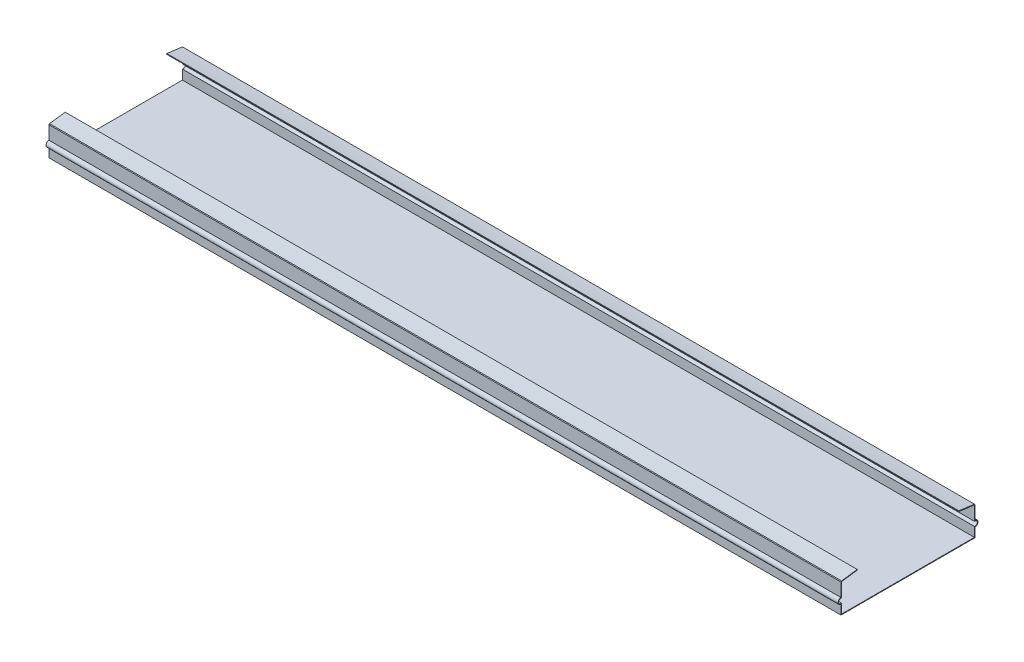
ISO-10303-21;
HEADER;
FILE_DESCRIPTION(('STEP AP214'),'2;1');
FILE_NAME('part.step','',(''),(''),'','','');
FILE_SCHEMA(('AUTOMOTIVE_DESIGN { 1 0 10303 214 1 1 1 1 }'));
ENDSEC;
DATA;
#1=APPLICATION_CONTEXT('core data for automotive mechanical design processes');
#2=APPLICATION_PROTOCOL_DEFINITION('international standard','automotive_design',2000,#1);
#3=PRODUCT_CONTEXT('',#1,'mechanical');
#4=PRODUCT('Part','Part','',(#3));
#5=PRODUCT_RELATED_PRODUCT_CATEGORY('part','',(#4));
#6=PRODUCT_DEFINITION_FORMATION('','',#4);
#7=PRODUCT_DEFINITION_CONTEXT('part definition',#1,'design');
#8=PRODUCT_DEFINITION('design','',#6,#7);
#9=PRODUCT_DEFINITION_SHAPE('','',#8);
#10=(LENGTH_UNIT() NAMED_UNIT(*) SI_UNIT(.MILLI.,.METRE.));
#11=(NAMED_UNIT(*) PLANE_ANGLE_UNIT() SI_UNIT($,.RADIAN.));
#12=(NAMED_UNIT(*) SI_UNIT($,.STERADIAN.) SOLID_ANGLE_UNIT());
#13=UNCERTAINTY_MEASURE_WITH_UNIT(LENGTH_MEASURE(1.E-05),#10,'distance_accuracy_value','');
#14=(GEOMETRIC_REPRESENTATION_CONTEXT(3) GLOBAL_UNCERTAINTY_ASSIGNED_CONTEXT((#13)) GLOBAL_UNIT_ASSIGNED_CONTEXT((#10,
#11,#12)) REPRESENTATION_CONTEXT('',''));
#15=CARTESIAN_POINT('',(0.,0.,0.));
#16=DIRECTION('',(0.,0.,1.));
#17=DIRECTION('',(1.,0.,0.));
#18=AXIS2_PLACEMENT_3D('',#15,#16,#17);
#19=CARTESIAN_POINT('',(0.,0.2,0.));
#20=DIRECTION('',(0.,1.,0.));
#21=DIRECTION('',(0.,0.,1.));
#22=AXIS2_PLACEMENT_3D('',#19,#20,#21);
#23=PLANE('',#22);
#24=DIRECTION('',(-1.,0.,0.));
#25=VECTOR('',#24,1.);
#26=CARTESIAN_POINT('',(120.981837705448,0.2,21.2968));
#27=LINE('',#26,#25);
#28=CARTESIAN_POINT('',(120.981837705448,0.2,21.2968));
#29=VERTEX_POINT('',#28);
#30=CARTESIAN_POINT('',(-133.018162294552,0.2,21.2968));
#31=VERTEX_POINT('',#30);
#32=EDGE_CURVE('E196',#29,#31,#27,.T.);
#33=ORIENTED_EDGE('',*,*,#32,.F.);
#34=DIRECTION('',(0.,0.,-1.));
#35=VECTOR('',#34,1.);
#36=CARTESIAN_POINT('',(120.981837705448,0.2,-21.5));
#37=LINE('',#36,#35);
#38=CARTESIAN_POINT('',(120.981837705448,0.2,-21.2968));
#39=VERTEX_POINT('',#38);
#40=EDGE_CURVE('E37',#29,#39,#37,.T.);
#41=ORIENTED_EDGE('',*,*,#40,.T.);
#42=DIRECTION('',(-1.,0.,0.));
#43=VECTOR('',#42,1.);
#44=CARTESIAN_POINT('',(120.981837705448,0.2,-21.2968));
#45=LINE('',#44,#43);
#46=CARTESIAN_POINT('',(-133.018162294552,0.2,-21.2968));
#47=VERTEX_POINT('',#46);
#48=EDGE_CURVE('E307',#39,#47,#45,.T.);
#49=ORIENTED_EDGE('',*,*,#48,.T.);
#50=DIRECTION('',(0.,0.,1.));
#51=VECTOR('',#50,1.);
#52=CARTESIAN_POINT('',(-133.018162294552,0.2,-21.5));
#53=LINE('',#52,#51);
#54=EDGE_CURVE('E51',#47,#31,#53,.T.);
#55=ORIENTED_EDGE('',*,*,#54,.T.);
#56=EDGE_LOOP('',(#33,#41,#49,#55));
#57=FACE_BOUND('',#56,.T.);
#58=ADVANCED_FACE('F33',(#57),#23,.T.);
#59=CARTESIAN_POINT('',(-133.018162294552,0.2,-21.5));
#60=DIRECTION('',(1.,0.,0.));
#61=DIRECTION('',(0.,0.,-1.));
#62=AXIS2_PLACEMENT_3D('',#59,#60,#61);
#63=PLANE('',#62);
#64=DIRECTION('',(0.,0.,1.));
#65=VECTOR('',#64,1.);
#66=CARTESIAN_POINT('',(-133.018162294552,0.,-21.5));
#67=LINE('',#66,#65);
#68=CARTESIAN_POINT('',(-133.018162294552,0.,-21.5));
#69=VERTEX_POINT('',#68);
#70=CARTESIAN_POINT('',(-133.018162294552,0.,21.5));
#71=VERTEX_POINT('',#70);
#72=EDGE_CURVE('E373',#69,#71,#67,.T.);
#73=ORIENTED_EDGE('',*,*,#72,.T.);
#74=DIRECTION('',(0.,-1.,0.));
#75=VECTOR('',#74,1.);
#76=CARTESIAN_POINT('',(-133.018162294552,0.2,21.5));
#77=LINE('',#76,#75);
#78=CARTESIAN_POINT('',(-133.018162294552,3.00561190530003,21.5));
#79=VERTEX_POINT('',#78);
#80=EDGE_CURVE('E11',#79,#71,#77,.T.);
#81=ORIENTED_EDGE('',*,*,#80,.F.);
#82=CARTESIAN_POINT('',(-133.018162294552,3.94490993934206,21.5));
#83=DIRECTION('',(-1.,0.,0.));
#84=DIRECTION('',(0.,0.,1.));
#85=AXIS2_PLACEMENT_3D('',#82,#83,#84);
#86=CIRCLE('',#85,0.939298034042025);
#87=CARTESIAN_POINT('',(-133.018162294552,4.88420797338408,21.5));
#88=VERTEX_POINT('',#87);
#89=EDGE_CURVE('E205',#79,#88,#86,.T.);
#90=ORIENTED_EDGE('',*,*,#89,.T.);
#91=DIRECTION('',(0.,1.,0.));
#92=VECTOR('',#91,1.);
#93=CARTESIAN_POINT('',(-133.018162294552,4.88420797338408,21.5));
#94=LINE('',#93,#92);
#95=CARTESIAN_POINT('',(-133.018162294552,9.2,21.5));
#96=VERTEX_POINT('',#95);
#97=EDGE_CURVE('E210',#88,#96,#94,.T.);
#98=ORIENTED_EDGE('',*,*,#97,.T.);
#99=DIRECTION('',(0.,0.741620224061098,-0.670819978282971));
#100=VECTOR('',#99,1.);
#101=CARTESIAN_POINT('',(-133.018162294552,9.40218142448018,21.3171202262577));
#102=LINE('',#101,#100);
#103=CARTESIAN_POINT('',(-133.018162294552,9.40218142448018,21.3171202262577));
#104=VERTEX_POINT('',#103);
#105=EDGE_CURVE('E463',#96,#104,#102,.T.);
#106=ORIENTED_EDGE('',*,*,#105,.T.);
#107=CARTESIAN_POINT('',(-133.018162294552,9.40218142448018,21.3171202262577));
#108=CARTESIAN_POINT('',(-133.018162294552,9.57156316738654,19.631812118589));
#109=CARTESIAN_POINT('',(-133.018162294552,9.79606406108942,17.9511350221585));
#110=CARTESIAN_POINT('',(-133.018162294552,10.0750848825269,16.2804761779272));
#111=B_SPLINE_CURVE_WITH_KNOTS('',3,(#107,#108,#109,#110),.UNSPECIFIED.,.F.,.F.,(4,4),(0.,1.),.UNSPECIFIED.);
#112=CARTESIAN_POINT('',(-133.018162294552,10.0750848825269,16.2804761779272));
#113=VERTEX_POINT('',#112);
#114=EDGE_CURVE('E458',#104,#113,#111,.T.);
#115=ORIENTED_EDGE('',*,*,#114,.T.);
#116=DIRECTION('',(0.,-0.986338561581543,-0.164730816598634));
#117=VECTOR('',#116,1.);
#118=CARTESIAN_POINT('',(-133.018162294552,10.0750848825269,16.2804761779272));
#119=LINE('',#118,#117);
#120=CARTESIAN_POINT('',(-133.018162294552,9.87466088681352,16.2470028759944));
#121=VERTEX_POINT('',#120);
#122=EDGE_CURVE('E452',#113,#121,#119,.T.);
#123=ORIENTED_EDGE('',*,*,#122,.T.);
#124=CARTESIAN_POINT('',(-133.018162294552,9.87466088681352,16.2470028759944));
#125=CARTESIAN_POINT('',(-133.018162294552,9.45496353887915,18.7599733511534));
#126=CARTESIAN_POINT('',(-133.018162294552,9.2,21.2968));
#127=B_SPLINE_CURVE_WITH_KNOTS('',2,(#124,#125,#126),.UNSPECIFIED.,.F.,.F.,(3,3),(0.,1.),.UNSPECIFIED.);
#128=CARTESIAN_POINT('',(-133.018162294552,9.2,21.2968));
#129=VERTEX_POINT('',#128);
#130=EDGE_CURVE('E447',#121,#129,#127,.T.);
#131=ORIENTED_EDGE('',*,*,#130,.T.);
#132=DIRECTION('',(0.,-1.,0.));
#133=VECTOR('',#132,1.);
#134=CARTESIAN_POINT('',(-133.018162294552,4.65240557588022,21.2968));
#135=LINE('',#134,#133);
#136=CARTESIAN_POINT('',(-133.018162294552,4.65240557588022,21.2968));
#137=VERTEX_POINT('',#136);
#138=EDGE_CURVE('E441',#129,#137,#135,.T.);
#139=ORIENTED_EDGE('',*,*,#138,.T.);
#140=CARTESIAN_POINT('',(-133.018162294552,3.94490993934206,21.5));
#141=DIRECTION('',(1.,0.,0.));
#142=DIRECTION('',(0.,0.,1.));
#143=AXIS2_PLACEMENT_3D('',#140,#141,#142);
#144=CIRCLE('',#143,0.736098034042025);
#145=CARTESIAN_POINT('',(-133.018162294552,3.2374143028039,21.2968));
#146=VERTEX_POINT('',#145);
#147=EDGE_CURVE('E439',#137,#146,#144,.T.);
#148=ORIENTED_EDGE('',*,*,#147,.T.);
#149=DIRECTION('',(0.,-1.,0.));
#150=VECTOR('',#149,1.);
#151=CARTESIAN_POINT('',(-133.018162294552,0.2,21.2968));
#152=LINE('',#151,#150);
#153=EDGE_CURVE('E436',#146,#31,#152,.T.);
#154=ORIENTED_EDGE('',*,*,#153,.T.);
#155=ORIENTED_EDGE('',*,*,#54,.F.);
#156=DIRECTION('',(0.,-1.,0.));
#157=VECTOR('',#156,1.);
#158=CARTESIAN_POINT('',(-133.018162294552,0.2,-21.2968));
#159=LINE('',#158,#157);
#160=CARTESIAN_POINT('',(-133.018162294552,3.2374143028039,-21.2968));
#161=VERTEX_POINT('',#160);
#162=EDGE_CURVE('E59',#161,#47,#159,.T.);
#163=ORIENTED_EDGE('',*,*,#162,.F.);
#164=CARTESIAN_POINT('',(-133.018162294552,3.94490993934206,-21.5));
#165=DIRECTION('',(-1.,0.,0.));
#166=DIRECTION('',(0.,0.,-1.));
#167=AXIS2_PLACEMENT_3D('',#164,#165,#166);
#168=CIRCLE('',#167,0.736098034042025);
#169=CARTESIAN_POINT('',(-133.018162294552,4.65240557588022,-21.2968));
#170=VERTEX_POINT('',#169);
#171=EDGE_CURVE('E300',#170,#161,#168,.T.);
#172=ORIENTED_EDGE('',*,*,#171,.F.);
#173=DIRECTION('',(0.,-1.,0.));
#174=VECTOR('',#173,1.);
#175=CARTESIAN_POINT('',(-133.018162294552,4.65240557588022,-21.2968));
#176=LINE('',#175,#174);
#177=CARTESIAN_POINT('',(-133.018162294552,9.2,-21.2968));
#178=VERTEX_POINT('',#177);
#179=EDGE_CURVE('E295',#178,#170,#176,.T.);
#180=ORIENTED_EDGE('',*,*,#179,.F.);
#181=CARTESIAN_POINT('',(-133.018162294552,9.87466088681352,-16.2470028759944));
#182=CARTESIAN_POINT('',(-133.018162294552,9.45496353887915,-18.7599733511534));
#183=CARTESIAN_POINT('',(-133.018162294552,9.2,-21.2968));
#184=B_SPLINE_CURVE_WITH_KNOTS('',2,(#181,#182,#183),.UNSPECIFIED.,.F.,.F.,(3,3),(0.,1.),.UNSPECIFIED.);
#185=CARTESIAN_POINT('',(-133.018162294552,9.87466088681352,-16.2470028759944));
#186=VERTEX_POINT('',#185);
#187=EDGE_CURVE('E291',#186,#178,#184,.T.);
#188=ORIENTED_EDGE('',*,*,#187,.F.);
#189=DIRECTION('',(0.,-0.986338561581543,0.164730816598634));
#190=VECTOR('',#189,1.);
#191=CARTESIAN_POINT('',(-133.018162294552,10.0750848825269,-16.2804761779272));
#192=LINE('',#191,#190);
#193=CARTESIAN_POINT('',(-133.018162294552,10.0750848825269,-16.2804761779272));
#194=VERTEX_POINT('',#193);
#195=EDGE_CURVE('E286',#194,#186,#192,.T.);
#196=ORIENTED_EDGE('',*,*,#195,.F.);
#197=CARTESIAN_POINT('',(-133.018162294552,9.40218142448018,-21.3171202262577));
#198=CARTESIAN_POINT('',(-133.018162294552,9.57156316738654,-19.631812118589));
#199=CARTESIAN_POINT('',(-133.018162294552,9.79606406108942,-17.9511350221585));
#200=CARTESIAN_POINT('',(-133.018162294552,10.0750848825269,-16.2804761779272));
#201=B_SPLINE_CURVE_WITH_KNOTS('',3,(#197,#198,#199,#200),.UNSPECIFIED.,.F.,.F.,(4,4),(0.,1.),.UNSPECIFIED.);
#202=CARTESIAN_POINT('',(-133.018162294552,9.40218142448018,-21.3171202262577));
#203=VERTEX_POINT('',#202);
#204=EDGE_CURVE('E282',#203,#194,#201,.T.);
#205=ORIENTED_EDGE('',*,*,#204,.F.);
#206=DIRECTION('',(0.,0.741620224061098,0.670819978282971));
#207=VECTOR('',#206,1.);
#208=CARTESIAN_POINT('',(-133.018162294552,9.40218142448018,-21.3171202262577));
#209=LINE('',#208,#207);
#210=CARTESIAN_POINT('',(-133.018162294552,9.2,-21.5));
#211=VERTEX_POINT('',#210);
#212=EDGE_CURVE('E280',#211,#203,#209,.T.);
#213=ORIENTED_EDGE('',*,*,#212,.F.);
#214=DIRECTION('',(0.,1.,0.));
#215=VECTOR('',#214,1.);
#216=CARTESIAN_POINT('',(-133.018162294552,4.88420797338408,-21.5));
#217=LINE('',#216,#215);
#218=CARTESIAN_POINT('',(-133.018162294552,4.88420797338408,-21.5));
#219=VERTEX_POINT('',#218);
#220=EDGE_CURVE('E278',#219,#211,#217,.T.);
#221=ORIENTED_EDGE('',*,*,#220,.F.);
#222=CARTESIAN_POINT('',(-133.018162294552,3.94490993934206,-21.5));
#223=DIRECTION('',(1.,0.,0.));
#224=DIRECTION('',(0.,0.,-1.));
#225=AXIS2_PLACEMENT_3D('',#222,#223,#224);
#226=CIRCLE('',#225,0.939298034042025);
#227=CARTESIAN_POINT('',(-133.018162294552,3.00561190530003,-21.5));
#228=VERTEX_POINT('',#227);
#229=EDGE_CURVE('E200',#228,#219,#226,.T.);
#230=ORIENTED_EDGE('',*,*,#229,.F.);
#231=DIRECTION('',(0.,-1.,0.));
#232=VECTOR('',#231,1.);
#233=CARTESIAN_POINT('',(-133.018162294552,0.2,-21.5));
#234=LINE('',#233,#232);
#235=EDGE_CURVE('E195',#228,#69,#234,.T.);
#236=ORIENTED_EDGE('',*,*,#235,.T.);
#237=EDGE_LOOP('',(#73,#81,#90,#98,#106,#115,#123,#131,#139,#148,#154,#155,#163,#172,#180,#188,
#196,#205,#213,#221,#230,#236));
#238=FACE_BOUND('',#237,.T.);
#239=ADVANCED_FACE('F35',(#238),#63,.F.);
#240=CARTESIAN_POINT('',(-133.018162294552,0.2,21.5));
#241=DIRECTION('',(0.,0.,-1.));
#242=DIRECTION('',(-1.,0.,0.));
#243=AXIS2_PLACEMENT_3D('',#240,#241,#242);
#244=PLANE('',#243);
#245=DIRECTION('',(1.,0.,0.));
#246=VECTOR('',#245,1.);
#247=CARTESIAN_POINT('',(-133.018162294552,0.,21.5));
#248=LINE('',#247,#246);
#249=CARTESIAN_POINT('',(120.981837705448,0.,21.5));
#250=VERTEX_POINT('',#249);
#251=EDGE_CURVE('E365',#71,#250,#248,.T.);
#252=ORIENTED_EDGE('',*,*,#251,.T.);
#253=DIRECTION('',(0.,-1.,0.));
#254=VECTOR('',#253,1.);
#255=CARTESIAN_POINT('',(120.981837705448,0.2,21.5));
#256=LINE('',#255,#254);
#257=CARTESIAN_POINT('',(120.981837705448,3.00561190530003,21.5));
#258=VERTEX_POINT('',#257);
#259=EDGE_CURVE('E43',#258,#250,#256,.T.);
#260=ORIENTED_EDGE('',*,*,#259,.F.);
#261=DIRECTION('',(-1.,0.,0.));
#262=VECTOR('',#261,1.);
#263=CARTESIAN_POINT('',(120.981837705448,3.00561190530003,21.5));
#264=LINE('',#263,#262);
#265=EDGE_CURVE('E471',#258,#79,#264,.T.);
#266=ORIENTED_EDGE('',*,*,#265,.T.);
#267=ORIENTED_EDGE('',*,*,#80,.T.);
#268=EDGE_LOOP('',(#252,#260,#266,#267));
#269=FACE_BOUND('',#268,.T.);
#270=ADVANCED_FACE('F358',(#269),#244,.F.);
#271=CARTESIAN_POINT('',(120.981837705448,0.2,-21.5));
#272=DIRECTION('',(-1.,0.,0.));
#273=DIRECTION('',(0.,0.,1.));
#274=AXIS2_PLACEMENT_3D('',#271,#272,#273);
#275=PLANE('',#274);
#276=DIRECTION('',(0.,0.,-1.));
#277=VECTOR('',#276,1.);
#278=CARTESIAN_POINT('',(120.981837705448,0.,-21.5));
#279=LINE('',#278,#277);
#280=CARTESIAN_POINT('',(120.981837705448,0.,-21.5));
#281=VERTEX_POINT('',#280);
#282=EDGE_CURVE('E372',#250,#281,#279,.T.);
#283=ORIENTED_EDGE('',*,*,#282,.T.);
#284=DIRECTION('',(0.,-1.,0.));
#285=VECTOR('',#284,1.);
#286=CARTESIAN_POINT('',(120.981837705448,0.2,-21.5));
#287=LINE('',#286,#285);
#288=CARTESIAN_POINT('',(120.981837705448,3.00561190530003,-21.5));
#289=VERTEX_POINT('',#288);
#290=EDGE_CURVE('E380',#289,#281,#287,.T.);
#291=ORIENTED_EDGE('',*,*,#290,.F.);
#292=CARTESIAN_POINT('',(120.981837705448,3.94490993934206,-21.5));
#293=DIRECTION('',(1.,0.,0.));
#294=DIRECTION('',(0.,0.,-1.));
#295=AXIS2_PLACEMENT_3D('',#292,#293,#294);
#296=CIRCLE('',#295,0.939298034042025);
#297=CARTESIAN_POINT('',(120.981837705448,4.88420797338408,-21.5));
#298=VERTEX_POINT('',#297);
#299=EDGE_CURVE('E312',#289,#298,#296,.T.);
#300=ORIENTED_EDGE('',*,*,#299,.T.);
#301=DIRECTION('',(0.,1.,0.));
#302=VECTOR('',#301,1.);
#303=CARTESIAN_POINT('',(120.981837705448,4.88420797338408,-21.5));
#304=LINE('',#303,#302);
#305=CARTESIAN_POINT('',(120.981837705448,9.2,-21.5));
#306=VERTEX_POINT('',#305);
#307=EDGE_CURVE('E316',#298,#306,#304,.T.);
#308=ORIENTED_EDGE('',*,*,#307,.T.);
#309=DIRECTION('',(0.,0.741620224061098,0.670819978282971));
#310=VECTOR('',#309,1.);
#311=CARTESIAN_POINT('',(120.981837705448,9.40218142448018,-21.3171202262577));
#312=LINE('',#311,#310);
#313=CARTESIAN_POINT('',(120.981837705448,9.40218142448018,-21.3171202262577));
#314=VERTEX_POINT('',#313);
#315=EDGE_CURVE('E320',#306,#314,#312,.T.);
#316=ORIENTED_EDGE('',*,*,#315,.T.);
#317=CARTESIAN_POINT('',(120.981837705448,9.40218142448018,-21.3171202262577));
#318=CARTESIAN_POINT('',(120.981837705448,9.57156316738654,-19.631812118589));
#319=CARTESIAN_POINT('',(120.981837705448,9.79606406108942,-17.9511350221585));
#320=CARTESIAN_POINT('',(120.981837705448,10.0750848825269,-16.2804761779272));
#321=B_SPLINE_CURVE_WITH_KNOTS('',3,(#317,#318,#319,#320),.UNSPECIFIED.,.F.,.F.,(4,4),(0.,1.),.UNSPECIFIED.);
#322=CARTESIAN_POINT('',(120.981837705448,10.0750848825269,-16.2804761779272));
#323=VERTEX_POINT('',#322);
#324=EDGE_CURVE('E324',#314,#323,#321,.T.);
#325=ORIENTED_EDGE('',*,*,#324,.T.);
#326=DIRECTION('',(0.,-0.986338561581543,0.164730816598634));
#327=VECTOR('',#326,1.);
#328=CARTESIAN_POINT('',(120.981837705448,10.0750848825269,-16.2804761779272));
#329=LINE('',#328,#327);
#330=CARTESIAN_POINT('',(120.981837705448,9.87466088681352,-16.2470028759944));
#331=VERTEX_POINT('',#330);
#332=EDGE_CURVE('E269',#323,#331,#329,.T.);
#333=ORIENTED_EDGE('',*,*,#332,.T.);
#334=CARTESIAN_POINT('',(120.981837705448,9.87466088681352,-16.2470028759944));
#335=CARTESIAN_POINT('',(120.981837705448,9.45496353887915,-18.7599733511534));
#336=CARTESIAN_POINT('',(120.981837705448,9.2,-21.2968));
#337=B_SPLINE_CURVE_WITH_KNOTS('',2,(#334,#335,#336),.UNSPECIFIED.,.F.,.F.,(3,3),(0.,1.),.UNSPECIFIED.);
#338=CARTESIAN_POINT('',(120.981837705448,9.2,-21.2968));
#339=VERTEX_POINT('',#338);
#340=EDGE_CURVE('E262',#331,#339,#337,.T.);
#341=ORIENTED_EDGE('',*,*,#340,.T.);
#342=DIRECTION('',(0.,-1.,0.));
#343=VECTOR('',#342,1.);
#344=CARTESIAN_POINT('',(120.981837705448,4.65240557588022,-21.2968));
#345=LINE('',#344,#343);
#346=CARTESIAN_POINT('',(120.981837705448,4.65240557588022,-21.2968));
#347=VERTEX_POINT('',#346);
#348=EDGE_CURVE('E268',#339,#347,#345,.T.);
#349=ORIENTED_EDGE('',*,*,#348,.T.);
#350=CARTESIAN_POINT('',(120.981837705448,3.94490993934206,-21.5));
#351=DIRECTION('',(-1.,0.,0.));
#352=DIRECTION('',(0.,0.,-1.));
#353=AXIS2_PLACEMENT_3D('',#350,#351,#352);
#354=CIRCLE('',#353,0.736098034042025);
#355=CARTESIAN_POINT('',(120.981837705448,3.2374143028039,-21.2968));
#356=VERTEX_POINT('',#355);
#357=EDGE_CURVE('E275',#347,#356,#354,.T.);
#358=ORIENTED_EDGE('',*,*,#357,.T.);
#359=DIRECTION('',(0.,-1.,0.));
#360=VECTOR('',#359,1.);
#361=CARTESIAN_POINT('',(120.981837705448,0.2,-21.2968));
#362=LINE('',#361,#360);
#363=EDGE_CURVE('E194',#356,#39,#362,.T.);
#364=ORIENTED_EDGE('',*,*,#363,.T.);
#365=ORIENTED_EDGE('',*,*,#40,.F.);
#366=DIRECTION('',(0.,-1.,0.));
#367=VECTOR('',#366,1.);
#368=CARTESIAN_POINT('',(120.981837705448,0.2,21.2968));
#369=LINE('',#368,#367);
#370=CARTESIAN_POINT('',(120.981837705448,3.2374143028039,21.2968));
#371=VERTEX_POINT('',#370);
#372=EDGE_CURVE('E191',#371,#29,#369,.T.);
#373=ORIENTED_EDGE('',*,*,#372,.F.);
#374=CARTESIAN_POINT('',(120.981837705448,3.94490993934206,21.5));
#375=DIRECTION('',(1.,0.,0.));
#376=DIRECTION('',(0.,0.,1.));
#377=AXIS2_PLACEMENT_3D('',#374,#375,#376);
#378=CIRCLE('',#377,0.736098034042025);
#379=CARTESIAN_POINT('',(120.981837705448,4.65240557588022,21.2968));
#380=VERTEX_POINT('',#379);
#381=EDGE_CURVE('E204',#380,#371,#378,.T.);
#382=ORIENTED_EDGE('',*,*,#381,.F.);
#383=DIRECTION('',(0.,-1.,0.));
#384=VECTOR('',#383,1.);
#385=CARTESIAN_POINT('',(120.981837705448,4.65240557588022,21.2968));
#386=LINE('',#385,#384);
#387=CARTESIAN_POINT('',(120.981837705448,9.2,21.2968));
#388=VERTEX_POINT('',#387);
#389=EDGE_CURVE('E207',#388,#380,#386,.T.);
#390=ORIENTED_EDGE('',*,*,#389,.F.);
#391=CARTESIAN_POINT('',(120.981837705448,9.87466088681352,16.2470028759944));
#392=CARTESIAN_POINT('',(120.981837705448,9.45496353887915,18.7599733511534));
#393=CARTESIAN_POINT('',(120.981837705448,9.2,21.2968));
#394=B_SPLINE_CURVE_WITH_KNOTS('',2,(#391,#392,#393),.UNSPECIFIED.,.F.,.F.,(3,3),(0.,1.),.UNSPECIFIED.);
#395=CARTESIAN_POINT('',(120.981837705448,9.87466088681352,16.2470028759944));
#396=VERTEX_POINT('',#395);
#397=EDGE_CURVE('E215',#396,#388,#394,.T.);
#398=ORIENTED_EDGE('',*,*,#397,.F.);
#399=DIRECTION('',(0.,-0.986338561581543,-0.164730816598634));
#400=VECTOR('',#399,1.);
#401=CARTESIAN_POINT('',(120.981837705448,10.0750848825269,16.2804761779272));
#402=LINE('',#401,#400);
#403=CARTESIAN_POINT('',(120.981837705448,10.0750848825269,16.2804761779272));
#404=VERTEX_POINT('',#403);
#405=EDGE_CURVE('E221',#404,#396,#402,.T.);
#406=ORIENTED_EDGE('',*,*,#405,.F.);
#407=CARTESIAN_POINT('',(120.981837705448,9.40218142448018,21.3171202262577));
#408=CARTESIAN_POINT('',(120.981837705448,9.57156316738654,19.631812118589));
#409=CARTESIAN_POINT('',(120.981837705448,9.79606406108942,17.9511350221585));
#410=CARTESIAN_POINT('',(120.981837705448,10.0750848825269,16.2804761779272));
#411=B_SPLINE_CURVE_WITH_KNOTS('',3,(#407,#408,#409,#410),.UNSPECIFIED.,.F.,.F.,(4,4),(0.,1.),.UNSPECIFIED.);
#412=CARTESIAN_POINT('',(120.981837705448,9.40218142448018,21.3171202262577));
#413=VERTEX_POINT('',#412);
#414=EDGE_CURVE('E496',#413,#404,#411,.T.);
#415=ORIENTED_EDGE('',*,*,#414,.F.);
#416=DIRECTION('',(0.,0.741620224061098,-0.670819978282971));
#417=VECTOR('',#416,1.);
#418=CARTESIAN_POINT('',(120.981837705448,9.40218142448018,21.3171202262577));
#419=LINE('',#418,#417);
#420=CARTESIAN_POINT('',(120.981837705448,9.2,21.5));
#421=VERTEX_POINT('',#420);
#422=EDGE_CURVE('E497',#421,#413,#419,.T.);
#423=ORIENTED_EDGE('',*,*,#422,.F.);
#424=DIRECTION('',(0.,1.,0.));
#425=VECTOR('',#424,1.);
#426=CARTESIAN_POINT('',(120.981837705448,4.88420797338408,21.5));
#427=LINE('',#426,#425);
#428=CARTESIAN_POINT('',(120.981837705448,4.88420797338408,21.5));
#429=VERTEX_POINT('',#428);
#430=EDGE_CURVE('E500',#429,#421,#427,.T.);
#431=ORIENTED_EDGE('',*,*,#430,.F.);
#432=CARTESIAN_POINT('',(120.981837705448,3.94490993934206,21.5));
#433=DIRECTION('',(-1.,0.,0.));
#434=DIRECTION('',(0.,0.,1.));
#435=AXIS2_PLACEMENT_3D('',#432,#433,#434);
#436=CIRCLE('',#435,0.939298034042025);
#437=EDGE_CURVE('E379',#258,#429,#436,.T.);
#438=ORIENTED_EDGE('',*,*,#437,.F.);
#439=ORIENTED_EDGE('',*,*,#259,.T.);
#440=EDGE_LOOP('',(#283,#291,#300,#308,#316,#325,#333,#341,#349,#358,#364,#365,#373,#382,#390,
#398,#406,#415,#423,#431,#438,#439));
#441=FACE_BOUND('',#440,.T.);
#442=ADVANCED_FACE('F188',(#441),#275,.F.);
#443=CARTESIAN_POINT('',(-133.018162294552,0.2,-21.5));
#444=DIRECTION('',(0.,0.,1.));
#445=DIRECTION('',(1.,0.,0.));
#446=AXIS2_PLACEMENT_3D('',#443,#444,#445);
#447=PLANE('',#446);
#448=DIRECTION('',(-1.,0.,0.));
#449=VECTOR('',#448,1.);
#450=CARTESIAN_POINT('',(-133.018162294552,0.,-21.5));
#451=LINE('',#450,#449);
#452=EDGE_CURVE('E383',#281,#69,#451,.T.);
#453=ORIENTED_EDGE('',*,*,#452,.T.);
#454=ORIENTED_EDGE('',*,*,#235,.F.);
#455=DIRECTION('',(-1.,0.,0.));
#456=VECTOR('',#455,1.);
#457=CARTESIAN_POINT('',(120.981837705448,3.00561190530003,-21.5));
#458=LINE('',#457,#456);
#459=EDGE_CURVE('E392',#289,#228,#458,.T.);
#460=ORIENTED_EDGE('',*,*,#459,.F.);
#461=ORIENTED_EDGE('',*,*,#290,.T.);
#462=EDGE_LOOP('',(#453,#454,#460,#461));
#463=FACE_BOUND('',#462,.T.);
#464=ADVANCED_FACE('F352',(#463),#447,.F.);
#465=CARTESIAN_POINT('',(0.,0.,0.));
#466=DIRECTION('',(0.,1.,0.));
#467=DIRECTION('',(0.,0.,1.));
#468=AXIS2_PLACEMENT_3D('',#465,#466,#467);
#469=PLANE('',#468);
#470=ORIENTED_EDGE('',*,*,#72,.F.);
#471=ORIENTED_EDGE('',*,*,#452,.F.);
#472=ORIENTED_EDGE('',*,*,#282,.F.);
#473=ORIENTED_EDGE('',*,*,#251,.F.);
#474=EDGE_LOOP('',(#470,#471,#472,#473));
#475=FACE_BOUND('',#474,.T.);
#476=ADVANCED_FACE('F346',(#475),#469,.F.);
#477=CARTESIAN_POINT('',(120.981837705448,3.94490993934206,-21.5));
#478=DIRECTION('',(-1.,0.,0.));
#479=DIRECTION('',(0.,0.,1.));
#480=AXIS2_PLACEMENT_3D('',#477,#478,#479);
#481=CYLINDRICAL_SURFACE('',#480,0.939298034042025);
#482=ORIENTED_EDGE('',*,*,#229,.T.);
#483=DIRECTION('',(-1.,0.,0.));
#484=VECTOR('',#483,1.);
#485=CARTESIAN_POINT('',(120.981837705448,4.88420797338408,-21.5));
#486=LINE('',#485,#484);
#487=EDGE_CURVE('E394',#298,#219,#486,.T.);
#488=ORIENTED_EDGE('',*,*,#487,.F.);
#489=ORIENTED_EDGE('',*,*,#299,.F.);
#490=ORIENTED_EDGE('',*,*,#459,.T.);
#491=EDGE_LOOP('',(#482,#488,#489,#490));
#492=FACE_BOUND('',#491,.T.);
#493=ADVANCED_FACE('F342',(#492),#481,.T.);
#494=CARTESIAN_POINT('',(120.981837705448,4.88420797338408,-21.5));
#495=DIRECTION('',(0.,0.,1.));
#496=DIRECTION('',(0.,-1.,0.));
#497=AXIS2_PLACEMENT_3D('',#494,#495,#496);
#498=PLANE('',#497);
#499=ORIENTED_EDGE('',*,*,#220,.T.);
#500=DIRECTION('',(-1.,0.,0.));
#501=VECTOR('',#500,1.);
#502=CARTESIAN_POINT('',(120.981837705448,9.2,-21.5));
#503=LINE('',#502,#501);
#504=EDGE_CURVE('E399',#306,#211,#503,.T.);
#505=ORIENTED_EDGE('',*,*,#504,.F.);
#506=ORIENTED_EDGE('',*,*,#307,.F.);
#507=ORIENTED_EDGE('',*,*,#487,.T.);
#508=EDGE_LOOP('',(#499,#505,#506,#507));
#509=FACE_BOUND('',#508,.T.);
#510=ADVANCED_FACE('F338',(#509),#498,.F.);
#511=CARTESIAN_POINT('',(120.981837705448,9.40218142448018,-21.3171202262577));
#512=DIRECTION('',(0.,-0.670819978282971,0.741620224061099));
#513=DIRECTION('',(0.,-0.741620224061099,-0.670819978282971));
#514=AXIS2_PLACEMENT_3D('',#511,#512,#513);
#515=PLANE('',#514);
#516=ORIENTED_EDGE('',*,*,#212,.T.);
#517=DIRECTION('',(-1.,0.,0.));
#518=VECTOR('',#517,1.);
#519=CARTESIAN_POINT('',(120.981837705448,9.40218142448018,-21.3171202262577));
#520=LINE('',#519,#518);
#521=EDGE_CURVE('E408',#314,#203,#520,.T.);
#522=ORIENTED_EDGE('',*,*,#521,.F.);
#523=ORIENTED_EDGE('',*,*,#315,.F.);
#524=ORIENTED_EDGE('',*,*,#504,.T.);
#525=EDGE_LOOP('',(#516,#522,#523,#524));
#526=FACE_BOUND('',#525,.T.);
#527=ADVANCED_FACE('F334',(#526),#515,.F.);
#528=DIRECTION('',(-1.,0.,0.));
#529=VECTOR('',#528,1.);
#530=SURFACE_OF_LINEAR_EXTRUSION('',#321,#529);
#531=ORIENTED_EDGE('',*,*,#204,.T.);
#532=DIRECTION('',(-1.,0.,0.));
#533=VECTOR('',#532,1.);
#534=CARTESIAN_POINT('',(120.981837705448,10.0750848825269,-16.2804761779272));
#535=LINE('',#534,#533);
#536=EDGE_CURVE('E411',#323,#194,#535,.T.);
#537=ORIENTED_EDGE('',*,*,#536,.F.);
#538=ORIENTED_EDGE('',*,*,#324,.F.);
#539=ORIENTED_EDGE('',*,*,#521,.T.);
#540=EDGE_LOOP('',(#531,#537,#538,#539));
#541=FACE_BOUND('',#540,.T.);
#542=ADVANCED_FACE('F331',(#541),#530,.F.);
#543=CARTESIAN_POINT('',(120.981837705448,10.0750848825269,-16.2804761779272));
#544=DIRECTION('',(0.,-0.164730816598634,-0.986338561581543));
#545=DIRECTION('',(0.,0.986338561581543,-0.164730816598634));
#546=AXIS2_PLACEMENT_3D('',#543,#544,#545);
#547=PLANE('',#546);
#548=ORIENTED_EDGE('',*,*,#195,.T.);
#549=DIRECTION('',(-1.,0.,0.));
#550=VECTOR('',#549,1.);
#551=CARTESIAN_POINT('',(120.981837705448,9.87466088681352,-16.2470028759944));
#552=LINE('',#551,#550);
#553=EDGE_CURVE('E417',#331,#186,#552,.T.);
#554=ORIENTED_EDGE('',*,*,#553,.F.);
#555=ORIENTED_EDGE('',*,*,#332,.F.);
#556=ORIENTED_EDGE('',*,*,#536,.T.);
#557=EDGE_LOOP('',(#548,#554,#555,#556));
#558=FACE_BOUND('',#557,.T.);
#559=ADVANCED_FACE('F259',(#558),#547,.F.);
#560=DIRECTION('',(-1.,0.,0.));
#561=VECTOR('',#560,1.);
#562=SURFACE_OF_LINEAR_EXTRUSION('',#337,#561);
#563=ORIENTED_EDGE('',*,*,#187,.T.);
#564=DIRECTION('',(-1.,0.,0.));
#565=VECTOR('',#564,1.);
#566=CARTESIAN_POINT('',(120.981837705448,9.2,-21.2968));
#567=LINE('',#566,#565);
#568=EDGE_CURVE('E426',#339,#178,#567,.T.);
#569=ORIENTED_EDGE('',*,*,#568,.F.);
#570=ORIENTED_EDGE('',*,*,#340,.F.);
#571=ORIENTED_EDGE('',*,*,#553,.T.);
#572=EDGE_LOOP('',(#563,#569,#570,#571));
#573=FACE_BOUND('',#572,.T.);
#574=ADVANCED_FACE('F254',(#573),#562,.F.);
#575=CARTESIAN_POINT('',(120.981837705448,4.65240557588022,-21.2968));
#576=DIRECTION('',(0.,0.,-1.));
#577=DIRECTION('',(-1.,0.,0.));
#578=AXIS2_PLACEMENT_3D('',#575,#576,#577);
#579=PLANE('',#578);
#580=ORIENTED_EDGE('',*,*,#179,.T.);
#581=DIRECTION('',(-1.,0.,0.));
#582=VECTOR('',#581,1.);
#583=CARTESIAN_POINT('',(120.981837705448,4.65240557588022,-21.2968));
#584=LINE('',#583,#582);
#585=EDGE_CURVE('E429',#347,#170,#584,.T.);
#586=ORIENTED_EDGE('',*,*,#585,.F.);
#587=ORIENTED_EDGE('',*,*,#348,.F.);
#588=ORIENTED_EDGE('',*,*,#568,.T.);
#589=EDGE_LOOP('',(#580,#586,#587,#588));
#590=FACE_BOUND('',#589,.T.);
#591=ADVANCED_FACE('F250',(#590),#579,.F.);
#592=CARTESIAN_POINT('',(120.981837705448,3.94490993934206,-21.5));
#593=DIRECTION('',(-1.,0.,0.));
#594=DIRECTION('',(0.,0.,1.));
#595=AXIS2_PLACEMENT_3D('',#592,#593,#594);
#596=CYLINDRICAL_SURFACE('',#595,0.736098034042025);
#597=ORIENTED_EDGE('',*,*,#171,.T.);
#598=DIRECTION('',(-1.,0.,0.));
#599=VECTOR('',#598,1.);
#600=CARTESIAN_POINT('',(120.981837705448,3.2374143028039,-21.2968));
#601=LINE('',#600,#599);
#602=EDGE_CURVE('E304',#356,#161,#601,.T.);
#603=ORIENTED_EDGE('',*,*,#602,.F.);
#604=ORIENTED_EDGE('',*,*,#357,.F.);
#605=ORIENTED_EDGE('',*,*,#585,.T.);
#606=EDGE_LOOP('',(#597,#603,#604,#605));
#607=FACE_BOUND('',#606,.T.);
#608=ADVANCED_FACE('F247',(#607),#596,.F.);
#609=CARTESIAN_POINT('',(120.981837705448,0.2,-21.2968));
#610=DIRECTION('',(0.,0.,-1.));
#611=DIRECTION('',(-1.,0.,0.));
#612=AXIS2_PLACEMENT_3D('',#609,#610,#611);
#613=PLANE('',#612);
#614=ORIENTED_EDGE('',*,*,#162,.T.);
#615=ORIENTED_EDGE('',*,*,#48,.F.);
#616=ORIENTED_EDGE('',*,*,#363,.F.);
#617=ORIENTED_EDGE('',*,*,#602,.T.);
#618=EDGE_LOOP('',(#614,#615,#616,#617));
#619=FACE_BOUND('',#618,.T.);
#620=ADVANCED_FACE('F244',(#619),#613,.F.);
#621=CARTESIAN_POINT('',(120.981837705448,0.2,21.2968));
#622=DIRECTION('',(0.,0.,-1.));
#623=DIRECTION('',(-1.,0.,0.));
#624=AXIS2_PLACEMENT_3D('',#621,#622,#623);
#625=PLANE('',#624);
#626=ORIENTED_EDGE('',*,*,#153,.F.);
#627=DIRECTION('',(-1.,0.,0.));
#628=VECTOR('',#627,1.);
#629=CARTESIAN_POINT('',(120.981837705448,3.2374143028039,21.2968));
#630=LINE('',#629,#628);
#631=EDGE_CURVE('E201',#371,#146,#630,.T.);
#632=ORIENTED_EDGE('',*,*,#631,.F.);
#633=ORIENTED_EDGE('',*,*,#372,.T.);
#634=ORIENTED_EDGE('',*,*,#32,.T.);
#635=EDGE_LOOP('',(#626,#632,#633,#634));
#636=FACE_BOUND('',#635,.T.);
#637=ADVANCED_FACE('F203',(#636),#625,.T.);
#638=CARTESIAN_POINT('',(120.981837705448,3.94490993934206,21.5));
#639=DIRECTION('',(-1.,0.,0.));
#640=DIRECTION('',(0.,0.,1.));
#641=AXIS2_PLACEMENT_3D('',#638,#639,#640);
#642=CYLINDRICAL_SURFACE('',#641,0.736098034042025);
#643=ORIENTED_EDGE('',*,*,#147,.F.);
#644=DIRECTION('',(-1.,0.,0.));
#645=VECTOR('',#644,1.);
#646=CARTESIAN_POINT('',(120.981837705448,4.65240557588022,21.2968));
#647=LINE('',#646,#645);
#648=EDGE_CURVE('E485',#380,#137,#647,.T.);
#649=ORIENTED_EDGE('',*,*,#648,.F.);
#650=ORIENTED_EDGE('',*,*,#381,.T.);
#651=ORIENTED_EDGE('',*,*,#631,.T.);
#652=EDGE_LOOP('',(#643,#649,#650,#651));
#653=FACE_BOUND('',#652,.T.);
#654=ADVANCED_FACE('F237',(#653),#642,.F.);
#655=CARTESIAN_POINT('',(120.981837705448,4.65240557588022,21.2968));
#656=DIRECTION('',(0.,0.,-1.));
#657=DIRECTION('',(-1.,0.,0.));
#658=AXIS2_PLACEMENT_3D('',#655,#656,#657);
#659=PLANE('',#658);
#660=ORIENTED_EDGE('',*,*,#138,.F.);
#661=DIRECTION('',(-1.,0.,0.));
#662=VECTOR('',#661,1.);
#663=CARTESIAN_POINT('',(120.981837705448,9.2,21.2968));
#664=LINE('',#663,#662);
#665=EDGE_CURVE('E483',#388,#129,#664,.T.);
#666=ORIENTED_EDGE('',*,*,#665,.F.);
#667=ORIENTED_EDGE('',*,*,#389,.T.);
#668=ORIENTED_EDGE('',*,*,#648,.T.);
#669=EDGE_LOOP('',(#660,#666,#667,#668));
#670=FACE_BOUND('',#669,.T.);
#671=ADVANCED_FACE('F232',(#670),#659,.T.);
#672=DIRECTION('',(-1.,0.,0.));
#673=VECTOR('',#672,1.);
#674=SURFACE_OF_LINEAR_EXTRUSION('',#394,#673);
#675=ORIENTED_EDGE('',*,*,#130,.F.);
#676=DIRECTION('',(-1.,0.,0.));
#677=VECTOR('',#676,1.);
#678=CARTESIAN_POINT('',(120.981837705448,9.87466088681352,16.2470028759944));
#679=LINE('',#678,#677);
#680=EDGE_CURVE('E481',#396,#121,#679,.T.);
#681=ORIENTED_EDGE('',*,*,#680,.F.);
#682=ORIENTED_EDGE('',*,*,#397,.T.);
#683=ORIENTED_EDGE('',*,*,#665,.T.);
#684=EDGE_LOOP('',(#675,#681,#682,#683));
#685=FACE_BOUND('',#684,.T.);
#686=ADVANCED_FACE('F227',(#685),#674,.T.);
#687=CARTESIAN_POINT('',(120.981837705448,10.0750848825269,16.2804761779272));
#688=DIRECTION('',(0.,0.164730816598634,-0.986338561581543));
#689=DIRECTION('',(0.,0.986338561581543,0.164730816598634));
#690=AXIS2_PLACEMENT_3D('',#687,#688,#689);
#691=PLANE('',#690);
#692=ORIENTED_EDGE('',*,*,#122,.F.);
#693=DIRECTION('',(-1.,0.,0.));
#694=VECTOR('',#693,1.);
#695=CARTESIAN_POINT('',(120.981837705448,10.0750848825269,16.2804761779272));
#696=LINE('',#695,#694);
#697=EDGE_CURVE('E479',#404,#113,#696,.T.);
#698=ORIENTED_EDGE('',*,*,#697,.F.);
#699=ORIENTED_EDGE('',*,*,#405,.T.);
#700=ORIENTED_EDGE('',*,*,#680,.T.);
#701=EDGE_LOOP('',(#692,#698,#699,#700));
#702=FACE_BOUND('',#701,.T.);
#703=ADVANCED_FACE('F231',(#702),#691,.T.);
#704=DIRECTION('',(-1.,0.,0.));
#705=VECTOR('',#704,1.);
#706=SURFACE_OF_LINEAR_EXTRUSION('',#411,#705);
#707=ORIENTED_EDGE('',*,*,#114,.F.);
#708=DIRECTION('',(-1.,0.,0.));
#709=VECTOR('',#708,1.);
#710=CARTESIAN_POINT('',(120.981837705448,9.40218142448018,21.3171202262577));
#711=LINE('',#710,#709);
#712=EDGE_CURVE('E477',#413,#104,#711,.T.);
#713=ORIENTED_EDGE('',*,*,#712,.F.);
#714=ORIENTED_EDGE('',*,*,#414,.T.);
#715=ORIENTED_EDGE('',*,*,#697,.T.);
#716=EDGE_LOOP('',(#707,#713,#714,#715));
#717=FACE_BOUND('',#716,.T.);
#718=ADVANCED_FACE('F508',(#717),#706,.T.);
#719=CARTESIAN_POINT('',(120.981837705448,9.40218142448018,21.3171202262577));
#720=DIRECTION('',(0.,0.670819978282971,0.741620224061099));
#721=DIRECTION('',(0.,-0.741620224061099,0.670819978282971));
#722=AXIS2_PLACEMENT_3D('',#719,#720,#721);
#723=PLANE('',#722);
#724=ORIENTED_EDGE('',*,*,#105,.F.);
#725=DIRECTION('',(-1.,0.,0.));
#726=VECTOR('',#725,1.);
#727=CARTESIAN_POINT('',(120.981837705448,9.2,21.5));
#728=LINE('',#727,#726);
#729=EDGE_CURVE('E475',#421,#96,#728,.T.);
#730=ORIENTED_EDGE('',*,*,#729,.F.);
#731=ORIENTED_EDGE('',*,*,#422,.T.);
#732=ORIENTED_EDGE('',*,*,#712,.T.);
#733=EDGE_LOOP('',(#724,#730,#731,#732));
#734=FACE_BOUND('',#733,.T.);
#735=ADVANCED_FACE('F511',(#734),#723,.T.);
#736=CARTESIAN_POINT('',(120.981837705448,4.88420797338408,21.5));
#737=DIRECTION('',(0.,0.,1.));
#738=DIRECTION('',(0.,-1.,0.));
#739=AXIS2_PLACEMENT_3D('',#736,#737,#738);
#740=PLANE('',#739);
#741=ORIENTED_EDGE('',*,*,#97,.F.);
#742=DIRECTION('',(-1.,0.,0.));
#743=VECTOR('',#742,1.);
#744=CARTESIAN_POINT('',(120.981837705448,4.88420797338408,21.5));
#745=LINE('',#744,#743);
#746=EDGE_CURVE('E473',#429,#88,#745,.T.);
#747=ORIENTED_EDGE('',*,*,#746,.F.);
#748=ORIENTED_EDGE('',*,*,#430,.T.);
#749=ORIENTED_EDGE('',*,*,#729,.T.);
#750=EDGE_LOOP('',(#741,#747,#748,#749));
#751=FACE_BOUND('',#750,.T.);
#752=ADVANCED_FACE('F514',(#751),#740,.T.);
#753=CARTESIAN_POINT('',(120.981837705448,3.94490993934206,21.5));
#754=DIRECTION('',(-1.,0.,0.));
#755=DIRECTION('',(0.,0.,1.));
#756=AXIS2_PLACEMENT_3D('',#753,#754,#755);
#757=CYLINDRICAL_SURFACE('',#756,0.939298034042025);
#758=ORIENTED_EDGE('',*,*,#89,.F.);
#759=ORIENTED_EDGE('',*,*,#265,.F.);
#760=ORIENTED_EDGE('',*,*,#437,.T.);
#761=ORIENTED_EDGE('',*,*,#746,.T.);
#762=EDGE_LOOP('',(#758,#759,#760,#761));
#763=FACE_BOUND('',#762,.T.);
#764=ADVANCED_FACE('F518',(#763),#757,.T.);
#765=CLOSED_SHELL('',(#58,#239,#270,#442,#464,#476,#493,#510,#527,#542,#559,#574,#591,#608,#620,
#637,#654,#671,#686,#703,#718,#735,#752,#764));
#766=MANIFOLD_SOLID_BREP('B2',#765);
#767=ADVANCED_BREP_SHAPE_REPRESENTATION('',(#18,#766),#14);
#768=SHAPE_DEFINITION_REPRESENTATION(#9,#767);
ENDSEC;
END-ISO-10303-21;
